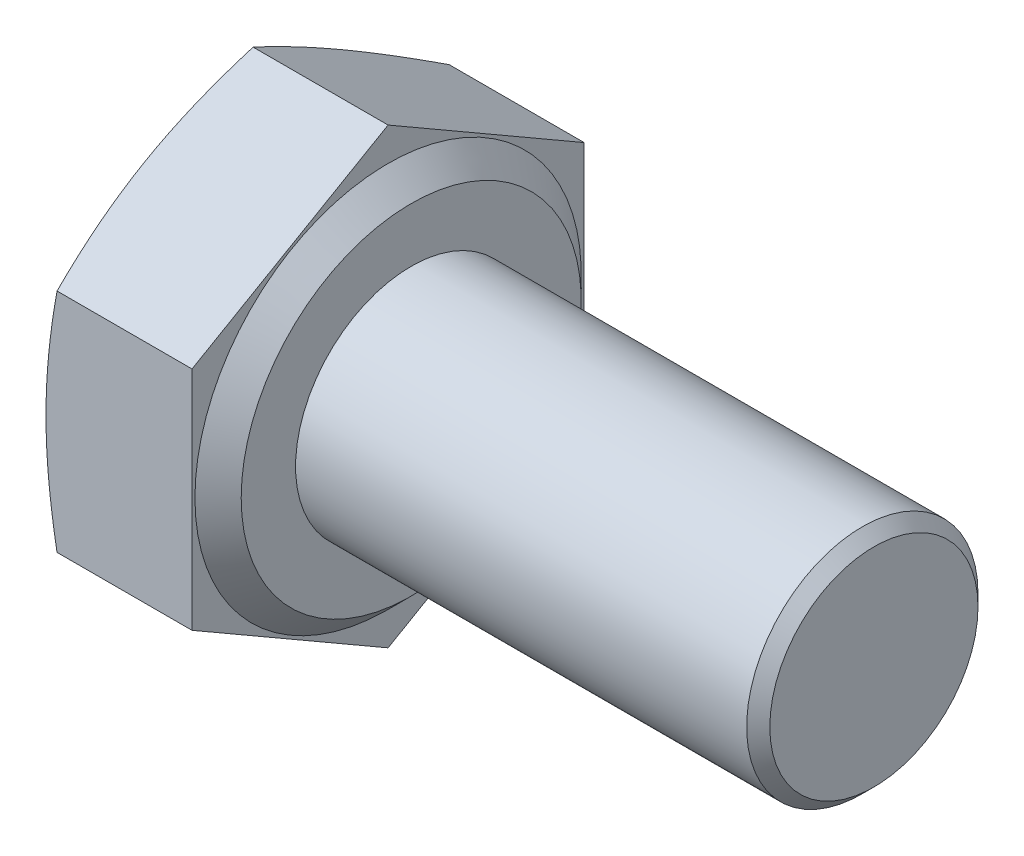
ISO-10303-21;
HEADER;
FILE_DESCRIPTION(('STEP AP214'),'2;1');
FILE_NAME('part.step','',(''),(''),'','','');
FILE_SCHEMA(('AUTOMOTIVE_DESIGN { 1 0 10303 214 1 1 1 1 }'));
ENDSEC;
DATA;
#1=APPLICATION_CONTEXT('core data for automotive mechanical design processes');
#2=APPLICATION_PROTOCOL_DEFINITION('international standard','automotive_design',2000,#1);
#3=PRODUCT_CONTEXT('',#1,'mechanical');
#4=PRODUCT('Part','Part','',(#3));
#5=PRODUCT_RELATED_PRODUCT_CATEGORY('part','',(#4));
#6=PRODUCT_DEFINITION_FORMATION('','',#4);
#7=PRODUCT_DEFINITION_CONTEXT('part definition',#1,'design');
#8=PRODUCT_DEFINITION('design','',#6,#7);
#9=PRODUCT_DEFINITION_SHAPE('','',#8);
#10=(LENGTH_UNIT() NAMED_UNIT(*) SI_UNIT(.MILLI.,.METRE.));
#11=(NAMED_UNIT(*) PLANE_ANGLE_UNIT() SI_UNIT($,.RADIAN.));
#12=(NAMED_UNIT(*) SI_UNIT($,.STERADIAN.) SOLID_ANGLE_UNIT());
#13=UNCERTAINTY_MEASURE_WITH_UNIT(LENGTH_MEASURE(1.E-05),#10,'distance_accuracy_value','');
#14=(GEOMETRIC_REPRESENTATION_CONTEXT(3) GLOBAL_UNCERTAINTY_ASSIGNED_CONTEXT((#13)) GLOBAL_UNIT_ASSIGNED_CONTEXT((#10,
#11,#12)) REPRESENTATION_CONTEXT('',''));
#15=CARTESIAN_POINT('',(0.,0.,0.));
#16=DIRECTION('',(0.,0.,1.));
#17=DIRECTION('',(1.,0.,0.));
#18=AXIS2_PLACEMENT_3D('',#15,#16,#17);
#19=CARTESIAN_POINT('',(2.925,-1.95721741255283,-3.39));
#20=DIRECTION('',(1.,0.,0.));
#21=DIRECTION('',(0.,0.,-1.));
#22=AXIS2_PLACEMENT_3D('',#19,#20,#21);
#23=PLANE('',#22);
#24=CARTESIAN_POINT('',(2.925,0.,0.));
#25=DIRECTION('',(-1.,0.,0.));
#26=DIRECTION('',(0.,0.,1.));
#27=AXIS2_PLACEMENT_3D('',#24,#25,#26);
#28=CIRCLE('',#27,2.94);
#29=CARTESIAN_POINT('',(2.925,0.,2.94));
#30=VERTEX_POINT('',#29);
#31=EDGE_CURVE('E267',#30,#30,#28,.T.);
#32=ORIENTED_EDGE('',*,*,#31,.F.);
#33=EDGE_LOOP('',(#32));
#34=FACE_BOUND('',#33,.T.);
#35=CARTESIAN_POINT('',(2.925,0.,0.));
#36=DIRECTION('',(1.,0.,0.));
#37=DIRECTION('',(0.,0.,-1.));
#38=AXIS2_PLACEMENT_3D('',#35,#36,#37);
#39=CIRCLE('',#38,2.);
#40=CARTESIAN_POINT('',(2.925,0.,-2.));
#41=VERTEX_POINT('',#40);
#42=EDGE_CURVE('E290',#41,#41,#39,.T.);
#43=ORIENTED_EDGE('',*,*,#42,.F.);
#44=EDGE_LOOP('',(#43));
#45=FACE_BOUND('',#44,.T.);
#46=ADVANCED_FACE('F37',(#34,#45),#23,.T.);
#47=CARTESIAN_POINT('',(2.925,-3.91443482510566,0.));
#48=DIRECTION('',(0.,0.866025403784439,0.5));
#49=DIRECTION('',(0.,-0.5,0.866025403784439));
#50=AXIS2_PLACEMENT_3D('',#47,#48,#49);
#51=PLANE('',#50);
#52=CARTESIAN_POINT('',(0.190920695673182,-1.957101942499,-3.3902));
#53=CARTESIAN_POINT('',(0.161404170530895,-2.03816412054654,-3.24979618904947));
#54=CARTESIAN_POINT('',(0.134553686064013,-2.11949362286094,-3.10892935888662));
#55=CARTESIAN_POINT('',(0.0873142945927193,-2.28268148917413,-2.82627968325343));
#56=CARTESIAN_POINT('',(0.0669304448507118,-2.36454021625955,-2.68449620889857));
#57=CARTESIAN_POINT('',(0.0339601092717301,-2.52787800101785,-2.40158686690143));
#58=CARTESIAN_POINT('',(0.0213017035221394,-2.6093533276861,-2.26046746154876));
#59=CARTESIAN_POINT('',(0.00432321252371615,-2.77249453116584,-1.97789860831391));
#60=CARTESIAN_POINT('',(0.,-2.85416032499754,-1.83644930415696));
#61=CARTESIAN_POINT('',(0.,-3.01749191266095,-1.55355069584304));
#62=CARTESIAN_POINT('',(0.00432321252371628,-3.09915770649266,-1.41210139168609));
#63=CARTESIAN_POINT('',(0.0213017035221395,-3.2622989099724,-1.12953253845124));
#64=CARTESIAN_POINT('',(0.03396010927173,-3.34377423664064,-0.98841313309857));
#65=CARTESIAN_POINT('',(0.0669304448507116,-3.50711202139895,-0.705503791101431));
#66=CARTESIAN_POINT('',(0.0873142945927192,-3.58897074848437,-0.563720316746574));
#67=CARTESIAN_POINT('',(0.134553686064013,-3.75215861479756,-0.281070641113375));
#68=CARTESIAN_POINT('',(0.161404170530895,-3.83348811711196,-0.140203810950534));
#69=CARTESIAN_POINT('',(0.190920695673182,-3.9145502951595,0.000200000000000314));
#70=B_SPLINE_CURVE_WITH_KNOTS('',3,(#52,#53,#54,#55,#56,#57,#58,#59,#60,#61,#62,#63,#64,#65,#66,
#67,#68,#69),.UNSPECIFIED.,.F.,.F.,(4,2,2,2,2,2,2,2,4),(0.,0.494419076649432,0.989223868307329,
1.47934907283627,1.96929035184584,2.45923163085541,2.94935683538435,3.44416162704224,
3.93858070369168),.UNSPECIFIED.);
#71=CARTESIAN_POINT('',(0.190878666151059,-1.95721741255283,-3.39));
#72=VERTEX_POINT('',#71);
#73=CARTESIAN_POINT('',(0.,-2.93582611882925,-1.695));
#74=VERTEX_POINT('',#73);
#75=EDGE_CURVE('E115',#72,#74,#70,.T.);
#76=ORIENTED_EDGE('',*,*,#75,.F.);
#77=DIRECTION('',(-1.,0.,0.));
#78=VECTOR('',#77,1.);
#79=CARTESIAN_POINT('',(2.925,-1.95721741255283,-3.39));
#80=LINE('',#79,#78);
#81=CARTESIAN_POINT('',(2.525,-1.95721741255283,-3.39));
#82=VERTEX_POINT('',#81);
#83=EDGE_CURVE('E144',#82,#72,#80,.T.);
#84=ORIENTED_EDGE('',*,*,#83,.F.);
#85=DIRECTION('',(0.,0.5,-0.866025403784439));
#86=VECTOR('',#85,1.);
#87=CARTESIAN_POINT('',(2.525,-3.91443482510566,0.));
#88=LINE('',#87,#86);
#89=CARTESIAN_POINT('',(2.525,-3.91443482510566,0.));
#90=VERTEX_POINT('',#89);
#91=EDGE_CURVE('E281',#90,#82,#88,.T.);
#92=ORIENTED_EDGE('',*,*,#91,.F.);
#93=DIRECTION('',(-1.,0.,0.));
#94=VECTOR('',#93,1.);
#95=CARTESIAN_POINT('',(2.925,-3.91443482510566,0.));
#96=LINE('',#95,#94);
#97=CARTESIAN_POINT('',(0.190878666151059,-3.91443482510566,0.));
#98=VERTEX_POINT('',#97);
#99=EDGE_CURVE('E138',#90,#98,#96,.T.);
#100=ORIENTED_EDGE('',*,*,#99,.T.);
#101=EDGE_CURVE('E168',#74,#98,#70,.T.);
#102=ORIENTED_EDGE('',*,*,#101,.F.);
#103=EDGE_LOOP('',(#76,#84,#92,#100,#102));
#104=FACE_BOUND('',#103,.T.);
#105=ADVANCED_FACE('F183',(#104),#51,.F.);
#106=CARTESIAN_POINT('',(2.925,-1.95721741255283,-3.39));
#107=DIRECTION('',(0.,0.,1.));
#108=DIRECTION('',(0.,-1.,0.));
#109=AXIS2_PLACEMENT_3D('',#106,#107,#108);
#110=PLANE('',#109);
#111=CARTESIAN_POINT('',(1.01998007678603,-5.18202410509163,-3.39));
#112=CARTESIAN_POINT('',(0.973277176762849,-5.02864822170094,-3.39));
#113=CARTESIAN_POINT('',(0.927119238703085,-4.87510331247703,-3.39));
#114=CARTESIAN_POINT('',(0.836194758716782,-4.56758939034287,-3.39));
#115=CARTESIAN_POINT('',(0.791428326892078,-4.41362034491715,-3.39));
#116=CARTESIAN_POINT('',(0.703513863025891,-4.10490856376807,-3.39));
#117=CARTESIAN_POINT('',(0.660369006348904,-3.95016492050159,-3.39));
#118=CARTESIAN_POINT('',(0.576202801499939,-3.64010200507502,-3.39));
#119=CARTESIAN_POINT('',(0.535181415200553,-3.484782743304,-3.39));
#120=CARTESIAN_POINT('',(0.456277510762572,-3.17538445925163,-3.39));
#121=CARTESIAN_POINT('',(0.418362526901899,-3.02131375772906,-3.39));
#122=CARTESIAN_POINT('',(0.345760529790443,-2.71240553569117,-3.39));
#123=CARTESIAN_POINT('',(0.311073573864594,-2.55756800160945,-3.39));
#124=CARTESIAN_POINT('',(0.245736758765149,-2.24709346969778,-3.39));
#125=CARTESIAN_POINT('',(0.215085474425353,-2.09145677436789,-3.39));
#126=CARTESIAN_POINT('',(0.158752164667213,-1.77927622101428,-3.39));
#127=CARTESIAN_POINT('',(0.133070087160047,-1.62273237251735,-3.39));
#128=CARTESIAN_POINT('',(0.0902615585085251,-1.3263632452864,-3.39));
#129=CARTESIAN_POINT('',(0.072498793785041,-1.186630742291,-3.39));
#130=CARTESIAN_POINT('',(0.0424324935505425,-0.906588726653338,-3.39));
#131=CARTESIAN_POINT('',(0.0301282586295319,-0.766279290261012,-3.39));
#132=CARTESIAN_POINT('',(0.0115684732453413,-0.485347279440113,-3.39));
#133=CARTESIAN_POINT('',(0.00530894293677256,-0.344724972229404,-3.39));
#134=CARTESIAN_POINT('',(-0.000843429893423229,-0.0633396783863413,-3.39));
#135=CARTESIAN_POINT('',(-0.000736317375710558,0.0774233072455347,-3.39));
#136=CARTESIAN_POINT('',(0.00585535566267391,0.359511701306454,-3.39));
#137=CARTESIAN_POINT('',(0.0123722567361676,0.500836341612035,-3.39));
#138=CARTESIAN_POINT('',(0.0314839470111385,0.783070380716634,-3.39));
#139=CARTESIAN_POINT('',(0.0440788822329299,0.923979769457707,-3.39));
#140=CARTESIAN_POINT('',(0.0747561485744452,1.20531436994922,-3.39));
#141=CARTESIAN_POINT('',(0.0928431929156334,1.34573906064201,-3.39));
#142=CARTESIAN_POINT('',(0.133775911633328,1.62588403716585,-3.39));
#143=CARTESIAN_POINT('',(0.156621611514635,1.76560431921738,-3.39));
#144=CARTESIAN_POINT('',(0.233780276143637,2.19842514715555,-3.39));
#145=CARTESIAN_POINT('',(0.294955918215654,2.4902988261707,-3.39));
#146=CARTESIAN_POINT('',(0.429080839522654,3.07133562475221,-3.39));
#147=CARTESIAN_POINT('',(0.502034359364771,3.36049772819358,-3.39));
#148=CARTESIAN_POINT('',(0.655790239761749,3.93710818694567,-3.39));
#149=CARTESIAN_POINT('',(0.736602633644144,4.22455384077741,-3.39));
#150=CARTESIAN_POINT('',(0.903426211229649,4.79786777350775,-3.39));
#151=CARTESIAN_POINT('',(0.98943657004869,5.0837362948706,-3.39));
#152=CARTESIAN_POINT('',(1.16408502975736,5.65121198647412,-3.39));
#153=CARTESIAN_POINT('',(1.25268364694426,5.93283136428861,-3.39));
#154=CARTESIAN_POINT('',(1.43239750842414,6.49527820284762,-3.39));
#155=CARTESIAN_POINT('',(1.52351287346205,6.77610562488198,-3.39));
#156=CARTESIAN_POINT('',(1.70722880846129,7.3360927138095,-3.39));
#157=CARTESIAN_POINT('',(1.79982243124751,7.61525466565297,-3.39));
#158=CARTESIAN_POINT('',(1.98639796935143,8.17308908237735,-3.39));
#159=CARTESIAN_POINT('',(2.08037976969451,8.45176158568094,-3.39));
#160=CARTESIAN_POINT('',(2.17484722699178,8.73026698474743,-3.39));
#161=B_SPLINE_CURVE_WITH_KNOTS('',3,(#111,#112,#113,#114,#115,#116,#117,#118,#119,#120,#121,
#122,#123,#124,#125,#126,#127,#128,#129,#130,#131,#132,#133,#134,#135,#136,#137,#138,#139,#140,
#141,#142,#143,#144,#145,#146,#147,#148,#149,#150,#151,#152,#153,#154,#155,#156,#157,#158,#159,
#160),.UNSPECIFIED.,.F.,.F.,(4,2,2,2,2,2,2,2,2,2,2,2,2,2,2,2,2,2,2,2,2,2,2,2,4),(0.,
0.480989792271756,0.962017546102269,1.44394277803494,1.92585935388377,2.40183391785973,
2.87781693281759,3.35363140461836,3.82944088850869,4.25191903672505,4.6743430365068,
5.09648872148725,5.51863142531311,5.94291503117238,6.36720883064169,6.79186778486699,
7.2165290151807,8.11074158336346,9.00527683242144,9.90096950308118,10.7965204043521,
11.6821863327967,12.5678948265152,13.4502426356523,14.3325177703547),.UNSPECIFIED.);
#162=CARTESIAN_POINT('',(0.190878666151059,1.95721741255283,-3.39));
#163=VERTEX_POINT('',#162);
#164=CARTESIAN_POINT('',(0.,0.,-3.39));
#165=VERTEX_POINT('',#164);
#166=EDGE_CURVE('E228',#163,#165,#161,.F.);
#167=ORIENTED_EDGE('',*,*,#166,.F.);
#168=DIRECTION('',(-1.,0.,0.));
#169=VECTOR('',#168,1.);
#170=CARTESIAN_POINT('',(2.925,1.95721741255283,-3.39));
#171=LINE('',#170,#169);
#172=CARTESIAN_POINT('',(2.525,1.95721741255283,-3.39));
#173=VERTEX_POINT('',#172);
#174=EDGE_CURVE('E135',#173,#163,#171,.T.);
#175=ORIENTED_EDGE('',*,*,#174,.F.);
#176=DIRECTION('',(0.,1.,0.));
#177=VECTOR('',#176,1.);
#178=CARTESIAN_POINT('',(2.525,-1.95721741255283,-3.39));
#179=LINE('',#178,#177);
#180=EDGE_CURVE('E279',#82,#173,#179,.T.);
#181=ORIENTED_EDGE('',*,*,#180,.F.);
#182=ORIENTED_EDGE('',*,*,#83,.T.);
#183=EDGE_CURVE('E126',#165,#72,#161,.F.);
#184=ORIENTED_EDGE('',*,*,#183,.F.);
#185=EDGE_LOOP('',(#167,#175,#181,#182,#184));
#186=FACE_BOUND('',#185,.T.);
#187=ADVANCED_FACE('F235',(#186),#110,.F.);
#188=CARTESIAN_POINT('',(2.925,1.95721741255283,-3.39));
#189=DIRECTION('',(0.,-0.866025403784439,0.5));
#190=DIRECTION('',(0.,-0.5,-0.866025403784439));
#191=AXIS2_PLACEMENT_3D('',#188,#189,#190);
#192=PLANE('',#191);
#193=CARTESIAN_POINT('',(0.190920695673182,3.9145502951595,0.000199999999999449));
#194=CARTESIAN_POINT('',(0.161404170530895,3.83348811711196,-0.140203810950535));
#195=CARTESIAN_POINT('',(0.134553686064012,3.75215861479756,-0.281070641113377));
#196=CARTESIAN_POINT('',(0.0873142945927189,3.58897074848437,-0.563720316746575));
#197=CARTESIAN_POINT('',(0.0669304448507113,3.50711202139895,-0.705503791101431));
#198=CARTESIAN_POINT('',(0.0339601092717296,3.34377423664064,-0.98841313309857));
#199=CARTESIAN_POINT('',(0.0213017035221391,3.2622989099724,-1.12953253845124));
#200=CARTESIAN_POINT('',(0.00432321252371582,3.09915770649266,-1.41210139168609));
#201=CARTESIAN_POINT('',(0.,3.01749191266095,-1.55355069584304));
#202=CARTESIAN_POINT('',(0.,2.85416032499754,-1.83644930415696));
#203=CARTESIAN_POINT('',(0.00432321252371573,2.77249453116584,-1.97789860831392));
#204=CARTESIAN_POINT('',(0.0213017035221391,2.6093533276861,-2.26046746154876));
#205=CARTESIAN_POINT('',(0.0339601092717297,2.52787800101785,-2.40158686690143));
#206=CARTESIAN_POINT('',(0.0669304448507114,2.36454021625954,-2.68449620889857));
#207=CARTESIAN_POINT('',(0.0873142945927188,2.28268148917413,-2.82627968325343));
#208=CARTESIAN_POINT('',(0.134553686064012,2.11949362286094,-3.10892935888663));
#209=CARTESIAN_POINT('',(0.161404170530895,2.03816412054653,-3.24979618904947));
#210=CARTESIAN_POINT('',(0.190920695673182,1.95710194249899,-3.3902));
#211=B_SPLINE_CURVE_WITH_KNOTS('',3,(#193,#194,#195,#196,#197,#198,#199,#200,#201,#202,#203,
#204,#205,#206,#207,#208,#209,#210),.UNSPECIFIED.,.F.,.F.,(4,2,2,2,2,2,2,2,4),(0.,
0.494419076649432,0.989223868307329,1.47934907283627,1.96929035184584,2.45923163085541,
2.94935683538435,3.44416162704224,3.93858070369168),.UNSPECIFIED.);
#212=CARTESIAN_POINT('',(0.190878666151059,3.91443482510566,0.));
#213=VERTEX_POINT('',#212);
#214=CARTESIAN_POINT('',(0.,2.93582611882925,-1.695));
#215=VERTEX_POINT('',#214);
#216=EDGE_CURVE('E52',#213,#215,#211,.T.);
#217=ORIENTED_EDGE('',*,*,#216,.F.);
#218=DIRECTION('',(-1.,0.,0.));
#219=VECTOR('',#218,1.);
#220=CARTESIAN_POINT('',(2.925,3.91443482510566,0.));
#221=LINE('',#220,#219);
#222=CARTESIAN_POINT('',(2.525,3.91443482510566,0.));
#223=VERTEX_POINT('',#222);
#224=EDGE_CURVE('E132',#223,#213,#221,.T.);
#225=ORIENTED_EDGE('',*,*,#224,.F.);
#226=DIRECTION('',(0.,0.5,0.866025403784439));
#227=VECTOR('',#226,1.);
#228=CARTESIAN_POINT('',(2.525,1.95721741255283,-3.39));
#229=LINE('',#228,#227);
#230=EDGE_CURVE('E277',#173,#223,#229,.T.);
#231=ORIENTED_EDGE('',*,*,#230,.F.);
#232=ORIENTED_EDGE('',*,*,#174,.T.);
#233=EDGE_CURVE('E229',#215,#163,#211,.T.);
#234=ORIENTED_EDGE('',*,*,#233,.F.);
#235=EDGE_LOOP('',(#217,#225,#231,#232,#234));
#236=FACE_BOUND('',#235,.T.);
#237=ADVANCED_FACE('F238',(#236),#192,.F.);
#238=CARTESIAN_POINT('',(2.925,3.91443482510566,0.));
#239=DIRECTION('',(0.,-0.866025403784439,-0.5));
#240=DIRECTION('',(0.,0.5,-0.866025403784439));
#241=AXIS2_PLACEMENT_3D('',#238,#239,#240);
#242=PLANE('',#241);
#243=CARTESIAN_POINT('',(0.190920695673182,1.95710194249899,3.3902));
#244=CARTESIAN_POINT('',(0.161404170530895,2.03816412054653,3.24979618904947));
#245=CARTESIAN_POINT('',(0.134553686064012,2.11949362286094,3.10892935888662));
#246=CARTESIAN_POINT('',(0.0873142945927189,2.28268148917413,2.82627968325343));
#247=CARTESIAN_POINT('',(0.0669304448507113,2.36454021625954,2.68449620889857));
#248=CARTESIAN_POINT('',(0.0339601092717297,2.52787800101785,2.40158686690143));
#249=CARTESIAN_POINT('',(0.0213017035221391,2.6093533276861,2.26046746154876));
#250=CARTESIAN_POINT('',(0.00432321252371583,2.77249453116584,1.97789860831391));
#251=CARTESIAN_POINT('',(0.,2.85416032499754,1.83644930415696));
#252=CARTESIAN_POINT('',(0.,3.01749191266095,1.55355069584304));
#253=CARTESIAN_POINT('',(0.00432321252371577,3.09915770649266,1.41210139168608));
#254=CARTESIAN_POINT('',(0.0213017035221391,3.2622989099724,1.12953253845124));
#255=CARTESIAN_POINT('',(0.0339601092717297,3.34377423664064,0.98841313309857));
#256=CARTESIAN_POINT('',(0.0669304448507114,3.50711202139895,0.705503791101431));
#257=CARTESIAN_POINT('',(0.0873142945927189,3.58897074848437,0.563720316746574));
#258=CARTESIAN_POINT('',(0.134553686064012,3.75215861479756,0.281070641113375));
#259=CARTESIAN_POINT('',(0.161404170530895,3.83348811711196,0.140203810950533));
#260=CARTESIAN_POINT('',(0.190920695673182,3.9145502951595,-0.000200000000000854));
#261=B_SPLINE_CURVE_WITH_KNOTS('',3,(#243,#244,#245,#246,#247,#248,#249,#250,#251,#252,#253,
#254,#255,#256,#257,#258,#259,#260),.UNSPECIFIED.,.F.,.F.,(4,2,2,2,2,2,2,2,4),(0.,
0.494419076649433,0.98922386830733,1.47934907283627,1.96929035184584,2.45923163085541,
2.94935683538435,3.44416162704225,3.93858070369168),.UNSPECIFIED.);
#262=CARTESIAN_POINT('',(0.190878666151059,1.95721741255283,3.39));
#263=VERTEX_POINT('',#262);
#264=CARTESIAN_POINT('',(0.,2.93582611882925,1.695));
#265=VERTEX_POINT('',#264);
#266=EDGE_CURVE('E60',#263,#265,#261,.T.);
#267=ORIENTED_EDGE('',*,*,#266,.F.);
#268=DIRECTION('',(-1.,0.,0.));
#269=VECTOR('',#268,1.);
#270=CARTESIAN_POINT('',(2.925,1.95721741255283,3.39));
#271=LINE('',#270,#269);
#272=CARTESIAN_POINT('',(2.525,1.95721741255283,3.39));
#273=VERTEX_POINT('',#272);
#274=EDGE_CURVE('E123',#273,#263,#271,.T.);
#275=ORIENTED_EDGE('',*,*,#274,.F.);
#276=DIRECTION('',(0.,-0.5,0.866025403784439));
#277=VECTOR('',#276,1.);
#278=CARTESIAN_POINT('',(2.525,3.91443482510566,0.));
#279=LINE('',#278,#277);
#280=EDGE_CURVE('E275',#223,#273,#279,.T.);
#281=ORIENTED_EDGE('',*,*,#280,.F.);
#282=ORIENTED_EDGE('',*,*,#224,.T.);
#283=EDGE_CURVE('E125',#265,#213,#261,.T.);
#284=ORIENTED_EDGE('',*,*,#283,.F.);
#285=EDGE_LOOP('',(#267,#275,#281,#282,#284));
#286=FACE_BOUND('',#285,.T.);
#287=ADVANCED_FACE('F121',(#286),#242,.F.);
#288=CARTESIAN_POINT('',(2.925,1.95721741255283,3.39));
#289=DIRECTION('',(0.,0.,-1.));
#290=DIRECTION('',(-1.,0.,0.));
#291=AXIS2_PLACEMENT_3D('',#288,#289,#290);
#292=PLANE('',#291);
#293=CARTESIAN_POINT('',(1.01997989354759,-5.18202350349092,3.39));
#294=CARTESIAN_POINT('',(0.973277002242209,-5.02864764339971,3.39));
#295=CARTESIAN_POINT('',(0.927119072876941,-4.87510275748851,3.39));
#296=CARTESIAN_POINT('',(0.8361946101753,-4.56758888202956,3.39));
#297=CARTESIAN_POINT('',(0.791428186940743,-4.41361985996635,3.39));
#298=CARTESIAN_POINT('',(0.703513740136747,-4.1049081257591,3.39));
#299=CARTESIAN_POINT('',(0.660368891930328,-3.9501645060724,3.39));
#300=CARTESIAN_POINT('',(0.576202703755944,-3.64010163790345,3.39));
#301=CARTESIAN_POINT('',(0.535181325660586,-3.48478239981026,3.39));
#302=CARTESIAN_POINT('',(0.456277437117914,-3.17538416295869,3.39));
#303=CARTESIAN_POINT('',(0.418362460953621,-3.02131348495735,3.39));
#304=CARTESIAN_POINT('',(0.345760478621677,-2.71240531015016,3.39));
#305=CARTESIAN_POINT('',(0.31107352977889,-2.55756779977792,3.39));
#306=CARTESIAN_POINT('',(0.245736727919534,-2.24709331546655,3.39));
#307=CARTESIAN_POINT('',(0.21508544973831,-2.09145664402713,3.39));
#308=CARTESIAN_POINT('',(0.158752150984607,-1.7792761387277,3.39));
#309=CARTESIAN_POINT('',(0.133070078323607,-1.62273231439442,3.39));
#310=CARTESIAN_POINT('',(0.0902615531817832,-1.32636320569982,3.39));
#311=CARTESIAN_POINT('',(0.0724987882413201,-1.18663069691261,3.39));
#312=CARTESIAN_POINT('',(0.0424324881028126,-0.906588669661408,3.39));
#313=CARTESIAN_POINT('',(0.0301282534946796,-0.766279227447351,3.39));
#314=CARTESIAN_POINT('',(0.0115684693108669,-0.485347204994703,3.39));
#315=CARTESIAN_POINT('',(0.00530893988923502,-0.344724891973987,3.39));
#316=CARTESIAN_POINT('',(-0.000843430608762594,-0.0633395865578561,3.39));
#317=CARTESIAN_POINT('',(-0.000736316645790254,0.0774234048370811,3.39));
#318=CARTESIAN_POINT('',(0.00585535977490633,0.35951181057951,3.39));
#319=CARTESIAN_POINT('',(0.0123722627973922,0.500836456802893,3.39));
#320=CARTESIAN_POINT('',(0.0314839573460987,0.78307050764183,3.39));
#321=CARTESIAN_POINT('',(0.0440788948926873,0.923979902199434,3.39));
#322=CARTESIAN_POINT('',(0.074756166127457,1.20531451424879,3.39));
#323=CARTESIAN_POINT('',(0.0928432130380239,1.34573921068275,3.39));
#324=CARTESIAN_POINT('',(0.133775937021107,1.62588419860853,3.39));
#325=CARTESIAN_POINT('',(0.156621639598428,1.76560448632084,3.39));
#326=CARTESIAN_POINT('',(0.233780310562575,2.19842531997454,3.39));
#327=CARTESIAN_POINT('',(0.2949559556305,2.49029899907325,3.39));
#328=CARTESIAN_POINT('',(0.429080881996319,3.07133579793218,3.39));
#329=CARTESIAN_POINT('',(0.50203440390027,3.36049790156764,3.39));
#330=CARTESIAN_POINT('',(0.655790287789299,3.93710836070672,3.39));
#331=CARTESIAN_POINT('',(0.736602683097901,4.22455401473238,3.39));
#332=CARTESIAN_POINT('',(0.903426263150168,4.79786794795153,3.39));
#333=CARTESIAN_POINT('',(0.989436623009952,5.08373646960921,3.39));
#334=CARTESIAN_POINT('',(1.16408508397131,5.65121216000977,3.39));
#335=CARTESIAN_POINT('',(1.25268370134974,5.93283153633288,3.39));
#336=CARTESIAN_POINT('',(1.43239756302466,6.49527837196232,3.39));
#337=CARTESIAN_POINT('',(1.52351292806606,6.77610579255849,3.39));
#338=CARTESIAN_POINT('',(1.70722886302289,7.3360928788821,3.39));
#339=CARTESIAN_POINT('',(1.79982248576516,7.61525482955922,3.39));
#340=CARTESIAN_POINT('',(1.98639802369662,8.17308924398157,3.39));
#341=CARTESIAN_POINT('',(2.08037982391118,8.45176174614947,3.39));
#342=CARTESIAN_POINT('',(2.17484728105455,8.73026714408881,3.39));
#343=B_SPLINE_CURVE_WITH_KNOTS('',3,(#293,#294,#295,#296,#297,#298,#299,#300,#301,#302,#303,
#304,#305,#306,#307,#308,#309,#310,#311,#312,#313,#314,#315,#316,#317,#318,#319,#320,#321,#322,
#323,#324,#325,#326,#327,#328,#329,#330,#331,#332,#333,#334,#335,#336,#337,#338,#339,#340,#341,
#342),.UNSPECIFIED.,.F.,.F.,(4,2,2,2,2,2,2,2,2,2,2,2,2,2,2,2,2,2,2,2,2,2,2,2,4),(0.,
0.480989717785644,0.962017397120821,1.44394255408912,1.92585905497698,2.40183354492129,
2.87781648583752,3.35363088376765,3.82944029381557,4.25191845933479,4.67434247641531,
5.09648817867019,5.51863089977051,5.94291452361967,6.36720834108242,6.79186731337204,
7.21652856175054,8.11074113208824,9.00527638324548,9.90096905563468,10.7965199586567,
11.6821858830082,12.5678943726271,13.4502421784021,14.3325173097535),.UNSPECIFIED.);
#344=CARTESIAN_POINT('',(0.190878666151059,-1.95721741255283,3.39));
#345=VERTEX_POINT('',#344);
#346=CARTESIAN_POINT('',(0.,0.,3.39));
#347=VERTEX_POINT('',#346);
#348=EDGE_CURVE('E117',#345,#347,#343,.T.);
#349=ORIENTED_EDGE('',*,*,#348,.F.);
#350=DIRECTION('',(-1.,0.,0.));
#351=VECTOR('',#350,1.);
#352=CARTESIAN_POINT('',(2.925,-1.95721741255283,3.39));
#353=LINE('',#352,#351);
#354=CARTESIAN_POINT('',(2.525,-1.95721741255283,3.39));
#355=VERTEX_POINT('',#354);
#356=EDGE_CURVE('E133',#355,#345,#353,.T.);
#357=ORIENTED_EDGE('',*,*,#356,.F.);
#358=DIRECTION('',(0.,-1.,0.));
#359=VECTOR('',#358,1.);
#360=CARTESIAN_POINT('',(2.525,1.95721741255283,3.39));
#361=LINE('',#360,#359);
#362=EDGE_CURVE('E131',#273,#355,#361,.T.);
#363=ORIENTED_EDGE('',*,*,#362,.F.);
#364=ORIENTED_EDGE('',*,*,#274,.T.);
#365=EDGE_CURVE('E107',#347,#263,#343,.T.);
#366=ORIENTED_EDGE('',*,*,#365,.F.);
#367=EDGE_LOOP('',(#349,#357,#363,#364,#366));
#368=FACE_BOUND('',#367,.T.);
#369=ADVANCED_FACE('F129',(#368),#292,.F.);
#370=CARTESIAN_POINT('',(2.925,-1.95721741255283,3.39));
#371=DIRECTION('',(0.,0.866025403784439,-0.5));
#372=DIRECTION('',(0.,0.5,0.866025403784439));
#373=AXIS2_PLACEMENT_3D('',#370,#371,#372);
#374=PLANE('',#373);
#375=CARTESIAN_POINT('',(0.190920695673182,-3.9145502951595,-0.000199999999999726));
#376=CARTESIAN_POINT('',(0.161404170530895,-3.83348811711196,0.140203810950534));
#377=CARTESIAN_POINT('',(0.134553686064013,-3.75215861479756,0.281070641113376));
#378=CARTESIAN_POINT('',(0.0873142945927191,-3.58897074848437,0.563720316746575));
#379=CARTESIAN_POINT('',(0.0669304448507115,-3.50711202139895,0.705503791101432));
#380=CARTESIAN_POINT('',(0.0339601092717298,-3.34377423664064,0.98841313309857));
#381=CARTESIAN_POINT('',(0.0213017035221393,-3.2622989099724,1.12953253845124));
#382=CARTESIAN_POINT('',(0.00432321252371596,-3.09915770649266,1.41210139168609));
#383=CARTESIAN_POINT('',(0.,-3.01749191266095,1.55355069584304));
#384=CARTESIAN_POINT('',(0.,-2.85416032499754,1.83644930415696));
#385=CARTESIAN_POINT('',(0.00432321252371604,-2.77249453116584,1.97789860831392));
#386=CARTESIAN_POINT('',(0.0213017035221394,-2.6093533276861,2.26046746154876));
#387=CARTESIAN_POINT('',(0.0339601092717299,-2.52787800101785,2.40158686690143));
#388=CARTESIAN_POINT('',(0.0669304448507115,-2.36454021625954,2.68449620889857));
#389=CARTESIAN_POINT('',(0.0873142945927191,-2.28268148917413,2.82627968325343));
#390=CARTESIAN_POINT('',(0.134553686064013,-2.11949362286094,3.10892935888663));
#391=CARTESIAN_POINT('',(0.161404170530895,-2.03816412054653,3.24979618904947));
#392=CARTESIAN_POINT('',(0.190920695673182,-1.95710194249899,3.3902));
#393=B_SPLINE_CURVE_WITH_KNOTS('',3,(#375,#376,#377,#378,#379,#380,#381,#382,#383,#384,#385,
#386,#387,#388,#389,#390,#391,#392),.UNSPECIFIED.,.F.,.F.,(4,2,2,2,2,2,2,2,4),(0.,
0.494419076649432,0.98922386830733,1.47934907283627,1.96929035184584,2.45923163085541,
2.94935683538435,3.44416162704224,3.93858070369168),.UNSPECIFIED.);
#394=CARTESIAN_POINT('',(0.,-2.93582611882925,1.695));
#395=VERTEX_POINT('',#394);
#396=EDGE_CURVE('E170',#98,#395,#393,.T.);
#397=ORIENTED_EDGE('',*,*,#396,.F.);
#398=ORIENTED_EDGE('',*,*,#99,.F.);
#399=DIRECTION('',(0.,-0.5,-0.866025403784439));
#400=VECTOR('',#399,1.);
#401=CARTESIAN_POINT('',(2.525,-1.95721741255283,3.39));
#402=LINE('',#401,#400);
#403=EDGE_CURVE('E147',#355,#90,#402,.T.);
#404=ORIENTED_EDGE('',*,*,#403,.F.);
#405=ORIENTED_EDGE('',*,*,#356,.T.);
#406=EDGE_CURVE('E215',#395,#345,#393,.T.);
#407=ORIENTED_EDGE('',*,*,#406,.F.);
#408=EDGE_LOOP('',(#397,#398,#404,#405,#407));
#409=FACE_BOUND('',#408,.T.);
#410=ADVANCED_FACE('F247',(#409),#374,.F.);
#411=CARTESIAN_POINT('',(2.525,3.34,0.));
#412=DIRECTION('',(1.,0.,0.));
#413=DIRECTION('',(0.,0.,-1.));
#414=AXIS2_PLACEMENT_3D('',#411,#412,#413);
#415=PLANE('',#414);
#416=CARTESIAN_POINT('',(2.525,0.,0.));
#417=DIRECTION('',(-1.,0.,0.));
#418=DIRECTION('',(0.,0.,1.));
#419=AXIS2_PLACEMENT_3D('',#416,#417,#418);
#420=CIRCLE('',#419,3.34);
#421=CARTESIAN_POINT('',(2.525,0.,3.34));
#422=VERTEX_POINT('',#421);
#423=EDGE_CURVE('E270',#422,#422,#420,.T.);
#424=ORIENTED_EDGE('',*,*,#423,.T.);
#425=EDGE_LOOP('',(#424));
#426=FACE_BOUND('',#425,.T.);
#427=ORIENTED_EDGE('',*,*,#91,.T.);
#428=ORIENTED_EDGE('',*,*,#180,.T.);
#429=ORIENTED_EDGE('',*,*,#230,.T.);
#430=ORIENTED_EDGE('',*,*,#280,.T.);
#431=ORIENTED_EDGE('',*,*,#362,.T.);
#432=ORIENTED_EDGE('',*,*,#403,.T.);
#433=EDGE_LOOP('',(#427,#428,#429,#430,#431,#432));
#434=FACE_BOUND('',#433,.T.);
#435=ADVANCED_FACE('F211',(#426,#434),#415,.T.);
#436=CARTESIAN_POINT('',(2.525,0.,0.));
#437=DIRECTION('',(-1.,0.,0.));
#438=DIRECTION('',(0.,0.,1.));
#439=AXIS2_PLACEMENT_3D('',#436,#437,#438);
#440=CONICAL_SURFACE('',#439,3.34,0.785398163397454);
#441=ORIENTED_EDGE('',*,*,#31,.T.);
#442=EDGE_LOOP('',(#441));
#443=FACE_BOUND('',#442,.T.);
#444=ORIENTED_EDGE('',*,*,#423,.F.);
#445=EDGE_LOOP('',(#444));
#446=FACE_BOUND('',#445,.T.);
#447=ADVANCED_FACE('F256',(#443,#446),#440,.T.);
#448=CARTESIAN_POINT('',(0.,0.,0.));
#449=DIRECTION('',(1.,0.,0.));
#450=DIRECTION('',(0.,0.,-1.));
#451=AXIS2_PLACEMENT_3D('',#448,#449,#450);
#452=CONICAL_SURFACE('',#451,3.39,1.22173047639604);
#453=ORIENTED_EDGE('',*,*,#183,.T.);
#454=ORIENTED_EDGE('',*,*,#75,.T.);
#455=CARTESIAN_POINT('',(0.,0.,0.));
#456=DIRECTION('',(1.,0.,0.));
#457=DIRECTION('',(0.,0.,-1.));
#458=AXIS2_PLACEMENT_3D('',#455,#456,#457);
#459=CIRCLE('',#458,3.39);
#460=EDGE_CURVE('E149',#74,#165,#459,.T.);
#461=ORIENTED_EDGE('',*,*,#460,.T.);
#462=EDGE_LOOP('',(#453,#454,#461));
#463=FACE_BOUND('',#462,.T.);
#464=ADVANCED_FACE('F176',(#463),#452,.T.);
#465=ORIENTED_EDGE('',*,*,#101,.T.);
#466=ORIENTED_EDGE('',*,*,#396,.T.);
#467=EDGE_CURVE('E151',#395,#74,#459,.T.);
#468=ORIENTED_EDGE('',*,*,#467,.T.);
#469=EDGE_LOOP('',(#465,#466,#468));
#470=FACE_BOUND('',#469,.T.);
#471=ADVANCED_FACE('F166',(#470),#452,.T.);
#472=ORIENTED_EDGE('',*,*,#348,.T.);
#473=EDGE_CURVE('E160',#347,#395,#459,.T.);
#474=ORIENTED_EDGE('',*,*,#473,.T.);
#475=ORIENTED_EDGE('',*,*,#406,.T.);
#476=EDGE_LOOP('',(#472,#474,#475));
#477=FACE_BOUND('',#476,.T.);
#478=ADVANCED_FACE('F208',(#477),#452,.T.);
#479=ORIENTED_EDGE('',*,*,#266,.T.);
#480=CARTESIAN_POINT('',(0.,0.,0.));
#481=DIRECTION('',(-1.,0.,0.));
#482=DIRECTION('',(0.,0.,1.));
#483=AXIS2_PLACEMENT_3D('',#480,#481,#482);
#484=CIRCLE('',#483,3.39);
#485=EDGE_CURVE('E110',#347,#265,#484,.T.);
#486=ORIENTED_EDGE('',*,*,#485,.F.);
#487=ORIENTED_EDGE('',*,*,#365,.T.);
#488=EDGE_LOOP('',(#479,#486,#487));
#489=FACE_BOUND('',#488,.T.);
#490=ADVANCED_FACE('F108',(#489),#452,.T.);
#491=ORIENTED_EDGE('',*,*,#216,.T.);
#492=EDGE_CURVE('E156',#215,#265,#459,.T.);
#493=ORIENTED_EDGE('',*,*,#492,.T.);
#494=ORIENTED_EDGE('',*,*,#283,.T.);
#495=EDGE_LOOP('',(#491,#493,#494));
#496=FACE_BOUND('',#495,.T.);
#497=ADVANCED_FACE('F202',(#496),#452,.T.);
#498=ORIENTED_EDGE('',*,*,#233,.T.);
#499=ORIENTED_EDGE('',*,*,#166,.T.);
#500=EDGE_CURVE('E152',#165,#215,#459,.T.);
#501=ORIENTED_EDGE('',*,*,#500,.T.);
#502=EDGE_LOOP('',(#498,#499,#501));
#503=FACE_BOUND('',#502,.T.);
#504=ADVANCED_FACE('F207',(#503),#452,.T.);
#505=CARTESIAN_POINT('',(0.,-1.95721741255283,-3.39));
#506=DIRECTION('',(1.,0.,0.));
#507=DIRECTION('',(0.,0.,-1.));
#508=AXIS2_PLACEMENT_3D('',#505,#506,#507);
#509=PLANE('',#508);
#510=ORIENTED_EDGE('',*,*,#500,.F.);
#511=ORIENTED_EDGE('',*,*,#460,.F.);
#512=ORIENTED_EDGE('',*,*,#467,.F.);
#513=ORIENTED_EDGE('',*,*,#473,.F.);
#514=ORIENTED_EDGE('',*,*,#485,.T.);
#515=ORIENTED_EDGE('',*,*,#492,.F.);
#516=EDGE_LOOP('',(#510,#511,#512,#513,#514,#515));
#517=FACE_BOUND('',#516,.T.);
#518=ADVANCED_FACE('F181',(#517),#509,.F.);
#519=CARTESIAN_POINT('',(10.925,0.,0.));
#520=DIRECTION('',(-1.,0.,0.));
#521=DIRECTION('',(0.,0.,1.));
#522=AXIS2_PLACEMENT_3D('',#519,#520,#521);
#523=CYLINDRICAL_SURFACE('',#522,2.);
#524=CARTESIAN_POINT('',(10.725,0.,0.));
#525=DIRECTION('',(1.,0.,0.));
#526=DIRECTION('',(0.,0.,-1.));
#527=AXIS2_PLACEMENT_3D('',#524,#525,#526);
#528=CIRCLE('',#527,2.);
#529=CARTESIAN_POINT('',(10.725,0.,-2.));
#530=VERTEX_POINT('',#529);
#531=EDGE_CURVE('E11',#530,#530,#528,.F.);
#532=ORIENTED_EDGE('',*,*,#531,.T.);
#533=EDGE_LOOP('',(#532));
#534=FACE_BOUND('',#533,.T.);
#535=ORIENTED_EDGE('',*,*,#42,.T.);
#536=EDGE_LOOP('',(#535));
#537=FACE_BOUND('',#536,.T.);
#538=ADVANCED_FACE('F209',(#534,#537),#523,.T.);
#539=CARTESIAN_POINT('',(10.925,0.,0.));
#540=DIRECTION('',(1.,0.,0.));
#541=DIRECTION('',(0.,0.,-1.));
#542=AXIS2_PLACEMENT_3D('',#539,#540,#541);
#543=PLANE('',#542);
#544=CARTESIAN_POINT('',(10.925,0.,0.));
#545=DIRECTION('',(1.,0.,0.));
#546=DIRECTION('',(0.,0.,-1.));
#547=AXIS2_PLACEMENT_3D('',#544,#545,#546);
#548=CIRCLE('',#547,1.8);
#549=CARTESIAN_POINT('',(10.925,0.,-1.8));
#550=VERTEX_POINT('',#549);
#551=EDGE_CURVE('E45',#550,#550,#548,.T.);
#552=ORIENTED_EDGE('',*,*,#551,.T.);
#553=EDGE_LOOP('',(#552));
#554=FACE_BOUND('',#553,.T.);
#555=ADVANCED_FACE('F297',(#554),#543,.T.);
#556=CARTESIAN_POINT('',(10.925,0.,0.));
#557=DIRECTION('',(-1.,0.,0.));
#558=DIRECTION('',(0.,0.,1.));
#559=AXIS2_PLACEMENT_3D('',#556,#557,#558);
#560=CONICAL_SURFACE('',#559,1.8,0.785398163397448);
#561=ORIENTED_EDGE('',*,*,#531,.F.);
#562=EDGE_LOOP('',(#561));
#563=FACE_BOUND('',#562,.T.);
#564=ORIENTED_EDGE('',*,*,#551,.F.);
#565=EDGE_LOOP('',(#564));
#566=FACE_BOUND('',#565,.T.);
#567=ADVANCED_FACE('F39',(#563,#566),#560,.T.);
#568=CLOSED_SHELL('',(#46,#105,#187,#237,#287,#369,#410,#435,#447,#464,#471,#478,#490,#497,#504,
#518,#538,#555,#567));
#569=MANIFOLD_SOLID_BREP('B2',#568);
#570=ADVANCED_BREP_SHAPE_REPRESENTATION('',(#18,#569),#14);
#571=SHAPE_DEFINITION_REPRESENTATION(#9,#570);
ENDSEC;
END-ISO-10303-21;
